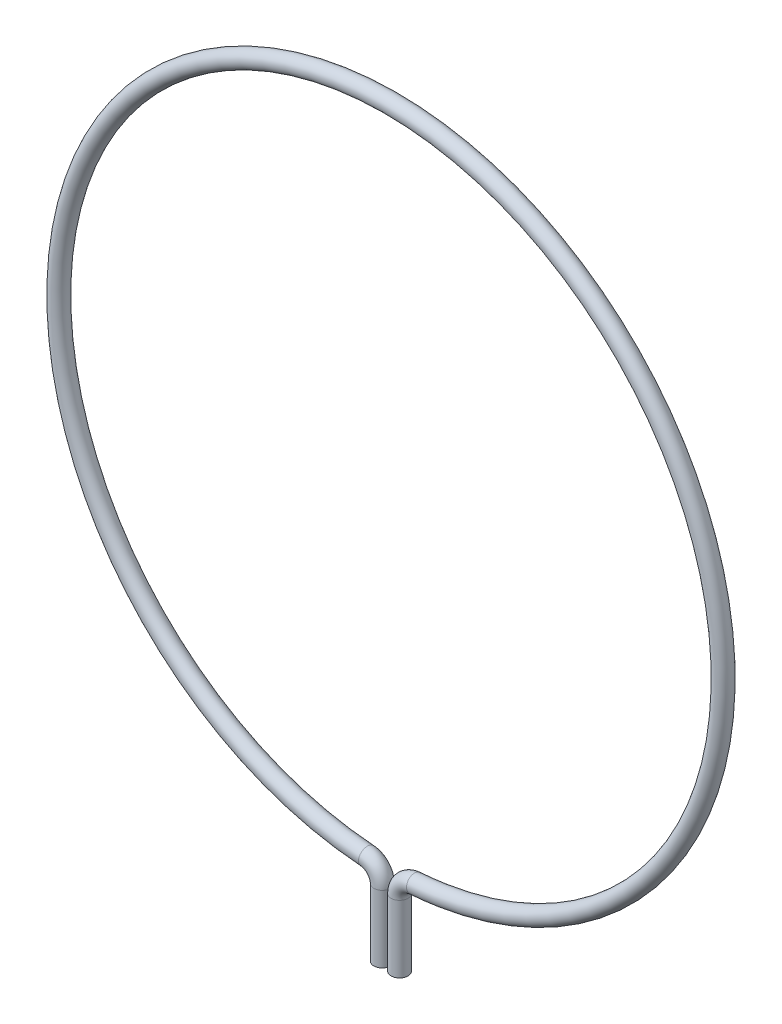
ISO-10303-21;
HEADER;
FILE_DESCRIPTION(('STEP AP214'),'2;1');
FILE_NAME('part.step','',(''),(''),'','','');
FILE_SCHEMA(('AUTOMOTIVE_DESIGN { 1 0 10303 214 1 1 1 1 }'));
ENDSEC;
DATA;
#1=APPLICATION_CONTEXT('core data for automotive mechanical design processes');
#2=APPLICATION_PROTOCOL_DEFINITION('international standard','automotive_design',2000,#1);
#3=PRODUCT_CONTEXT('',#1,'mechanical');
#4=PRODUCT('Part','Part','',(#3));
#5=PRODUCT_RELATED_PRODUCT_CATEGORY('part','',(#4));
#6=PRODUCT_DEFINITION_FORMATION('','',#4);
#7=PRODUCT_DEFINITION_CONTEXT('part definition',#1,'design');
#8=PRODUCT_DEFINITION('design','',#6,#7);
#9=PRODUCT_DEFINITION_SHAPE('','',#8);
#10=(LENGTH_UNIT() NAMED_UNIT(*) SI_UNIT(.MILLI.,.METRE.));
#11=(NAMED_UNIT(*) PLANE_ANGLE_UNIT() SI_UNIT($,.RADIAN.));
#12=(NAMED_UNIT(*) SI_UNIT($,.STERADIAN.) SOLID_ANGLE_UNIT());
#13=UNCERTAINTY_MEASURE_WITH_UNIT(LENGTH_MEASURE(1.E-05),#10,'distance_accuracy_value','');
#14=(GEOMETRIC_REPRESENTATION_CONTEXT(3) GLOBAL_UNCERTAINTY_ASSIGNED_CONTEXT((#13)) GLOBAL_UNIT_ASSIGNED_CONTEXT((#10,
#11,#12)) REPRESENTATION_CONTEXT('',''));
#15=CARTESIAN_POINT('',(0.,0.,0.));
#16=DIRECTION('',(0.,0.,1.));
#17=DIRECTION('',(1.,0.,0.));
#18=AXIS2_PLACEMENT_3D('',#15,#16,#17);
#19=CARTESIAN_POINT('',(-0.660400000000001,-31.7414133486106,0.));
#20=DIRECTION('',(0.,-1.,0.));
#21=DIRECTION('',(0.,0.,1.));
#22=AXIS2_PLACEMENT_3D('',#19,#20,#21);
#23=PLANE('',#22);
#24=CARTESIAN_POINT('',(-0.660400000000001,-31.7414133486106,0.));
#25=DIRECTION('',(0.,-1.,0.));
#26=DIRECTION('',(0.,0.,1.));
#27=AXIS2_PLACEMENT_3D('',#24,#25,#26);
#28=CIRCLE('',#27,0.6477);
#29=CARTESIAN_POINT('',(-0.660400000000001,-31.7414133486106,0.6477));
#30=VERTEX_POINT('',#29);
#31=EDGE_CURVE('E44',#30,#30,#28,.T.);
#32=ORIENTED_EDGE('',*,*,#31,.T.);
#33=EDGE_LOOP('',(#32));
#34=FACE_BOUND('',#33,.T.);
#35=ADVANCED_FACE('F32',(#34),#23,.T.);
#36=CARTESIAN_POINT('',(0.660400000000001,-31.7414133486106,0.));
#37=DIRECTION('',(0.,1.,0.));
#38=DIRECTION('',(0.,0.,1.));
#39=AXIS2_PLACEMENT_3D('',#36,#37,#38);
#40=PLANE('',#39);
#41=CARTESIAN_POINT('',(0.660400000000001,-31.7414133486106,0.));
#42=DIRECTION('',(0.,1.,0.));
#43=DIRECTION('',(0.,0.,1.));
#44=AXIS2_PLACEMENT_3D('',#41,#42,#43);
#45=CIRCLE('',#44,0.6477);
#46=CARTESIAN_POINT('',(0.660400000000001,-31.7414133486106,0.6477));
#47=VERTEX_POINT('',#46);
#48=EDGE_CURVE('E11',#47,#47,#45,.T.);
#49=ORIENTED_EDGE('',*,*,#48,.F.);
#50=EDGE_LOOP('',(#49));
#51=FACE_BOUND('',#50,.T.);
#52=ADVANCED_FACE('F50',(#51),#40,.F.);
#53=CARTESIAN_POINT('',(-0.660400000000001,-31.7414133486106,0.));
#54=DIRECTION('',(0.,1.,0.));
#55=DIRECTION('',(-1.,0.,0.));
#56=AXIS2_PLACEMENT_3D('',#53,#54,#55);
#57=CYLINDRICAL_SURFACE('',#56,0.6477);
#58=CARTESIAN_POINT('',(-0.6604,-26.600046162366,0.));
#59=DIRECTION('',(0.,-1.,0.));
#60=DIRECTION('',(0.,0.,1.));
#61=AXIS2_PLACEMENT_3D('',#58,#59,#60);
#62=CIRCLE('',#61,0.6477);
#63=CARTESIAN_POINT('',(-0.0127000000000018,-26.600046162366,0.));
#64=VERTEX_POINT('',#63);
#65=EDGE_CURVE('E84',#64,#64,#62,.T.);
#66=ORIENTED_EDGE('',*,*,#65,.T.);
#67=EDGE_LOOP('',(#66));
#68=FACE_BOUND('',#67,.T.);
#69=ORIENTED_EDGE('',*,*,#31,.F.);
#70=EDGE_LOOP('',(#69));
#71=FACE_BOUND('',#70,.T.);
#72=ADVANCED_FACE('F52',(#68,#71),#57,.T.);
#73=CARTESIAN_POINT('',(-1.9304,-26.600046162366,0.));
#74=DIRECTION('',(0.,0.,1.));
#75=DIRECTION('',(1.,0.,0.));
#76=AXIS2_PLACEMENT_3D('',#73,#74,#75);
#77=TOROIDAL_SURFACE('',#76,1.27,0.6477);
#78=CARTESIAN_POINT('',(-1.83847619047619,-25.3333772974914,0.));
#79=DIRECTION('',(0.997377058956354,-0.072380952380952,0.));
#80=DIRECTION('',(0.,0.,1.));
#81=AXIS2_PLACEMENT_3D('',#78,#79,#80);
#82=CIRCLE('',#81,0.6477);
#83=CARTESIAN_POINT('',(-1.79159504761905,-24.6873761764054,0.));
#84=VERTEX_POINT('',#83);
#85=EDGE_CURVE('E81',#84,#84,#82,.T.);
#86=CARTESIAN_POINT('',(-1.9304,-26.600046162366,0.));
#87=DIRECTION('',(0.,0.,1.));
#88=DIRECTION('',(1.,0.,0.));
#89=AXIS2_PLACEMENT_3D('',#86,#87,#88);
#90=CIRCLE('',#89,1.9177);
#91=EDGE_CURVE('',#64,#84,#90,.T.);
#92=ORIENTED_EDGE('',*,*,#65,.F.);
#93=ORIENTED_EDGE('',*,*,#85,.T.);
#94=ORIENTED_EDGE('',*,*,#91,.T.);
#95=ORIENTED_EDGE('',*,*,#91,.F.);
#96=EDGE_LOOP('',(#92,#94,#93,#95));
#97=FACE_BOUND('',#96,.T.);
#98=ADVANCED_FACE('F57',(#97),#77,.T.);
#99=CARTESIAN_POINT('',(0.,0.,0.));
#100=DIRECTION('',(0.,0.,-1.));
#101=DIRECTION('',(-1.,0.,0.));
#102=AXIS2_PLACEMENT_3D('',#99,#100,#101);
#103=TOROIDAL_SURFACE('',#102,25.4,0.6477);
#104=CARTESIAN_POINT('',(1.83847619047618,-25.3333772974914,0.));
#105=DIRECTION('',(0.997377058956354,0.072380952380952,0.));
#106=DIRECTION('',(0.,0.,1.));
#107=AXIS2_PLACEMENT_3D('',#104,#105,#106);
#108=CIRCLE('',#107,0.6477);
#109=CARTESIAN_POINT('',(1.79159504761903,-24.6873761764054,0.));
#110=VERTEX_POINT('',#109);
#111=EDGE_CURVE('E86',#110,#110,#108,.T.);
#112=ORIENTED_EDGE('',*,*,#111,.T.);
#113=EDGE_LOOP('',(#112));
#114=FACE_BOUND('',#113,.T.);
#115=ORIENTED_EDGE('',*,*,#85,.F.);
#116=EDGE_LOOP('',(#115));
#117=FACE_BOUND('',#116,.T.);
#118=ADVANCED_FACE('F67',(#114,#117),#103,.T.);
#119=CARTESIAN_POINT('',(1.9304,-26.600046162366,0.));
#120=DIRECTION('',(0.,0.,1.));
#121=DIRECTION('',(1.,0.,0.));
#122=AXIS2_PLACEMENT_3D('',#119,#120,#121);
#123=TOROIDAL_SURFACE('',#122,1.26999999999999,0.6477);
#124=CARTESIAN_POINT('',(0.660400000000006,-26.600046162366,0.));
#125=DIRECTION('',(0.,1.,0.));
#126=DIRECTION('',(0.,0.,1.));
#127=AXIS2_PLACEMENT_3D('',#124,#125,#126);
#128=CIRCLE('',#127,0.6477);
#129=CARTESIAN_POINT('',(0.0127000000000061,-26.600046162366,0.));
#130=VERTEX_POINT('',#129);
#131=EDGE_CURVE('E39',#130,#130,#128,.T.);
#132=CARTESIAN_POINT('',(1.9304,-26.600046162366,0.));
#133=DIRECTION('',(0.,0.,1.));
#134=DIRECTION('',(1.,0.,0.));
#135=AXIS2_PLACEMENT_3D('',#132,#133,#134);
#136=CIRCLE('',#135,1.91769999999999);
#137=EDGE_CURVE('',#110,#130,#136,.T.);
#138=ORIENTED_EDGE('',*,*,#111,.F.);
#139=ORIENTED_EDGE('',*,*,#131,.T.);
#140=ORIENTED_EDGE('',*,*,#137,.T.);
#141=ORIENTED_EDGE('',*,*,#137,.F.);
#142=EDGE_LOOP('',(#138,#140,#139,#141));
#143=FACE_BOUND('',#142,.T.);
#144=ADVANCED_FACE('F63',(#143),#123,.T.);
#145=CARTESIAN_POINT('',(0.6604,-26.600046162366,0.));
#146=DIRECTION('',(0.,-1.,0.));
#147=DIRECTION('',(1.,0.,0.));
#148=AXIS2_PLACEMENT_3D('',#145,#146,#147);
#149=CYLINDRICAL_SURFACE('',#148,0.6477);
#150=ORIENTED_EDGE('',*,*,#48,.T.);
#151=EDGE_LOOP('',(#150));
#152=FACE_BOUND('',#151,.T.);
#153=ORIENTED_EDGE('',*,*,#131,.F.);
#154=EDGE_LOOP('',(#153));
#155=FACE_BOUND('',#154,.T.);
#156=ADVANCED_FACE('F47',(#152,#155),#149,.T.);
#157=CLOSED_SHELL('',(#35,#52,#72,#98,#118,#144,#156));
#158=MANIFOLD_SOLID_BREP('B2',#157);
#159=ADVANCED_BREP_SHAPE_REPRESENTATION('',(#18,#158),#14);
#160=SHAPE_DEFINITION_REPRESENTATION(#9,#159);
ENDSEC;
END-ISO-10303-21;
